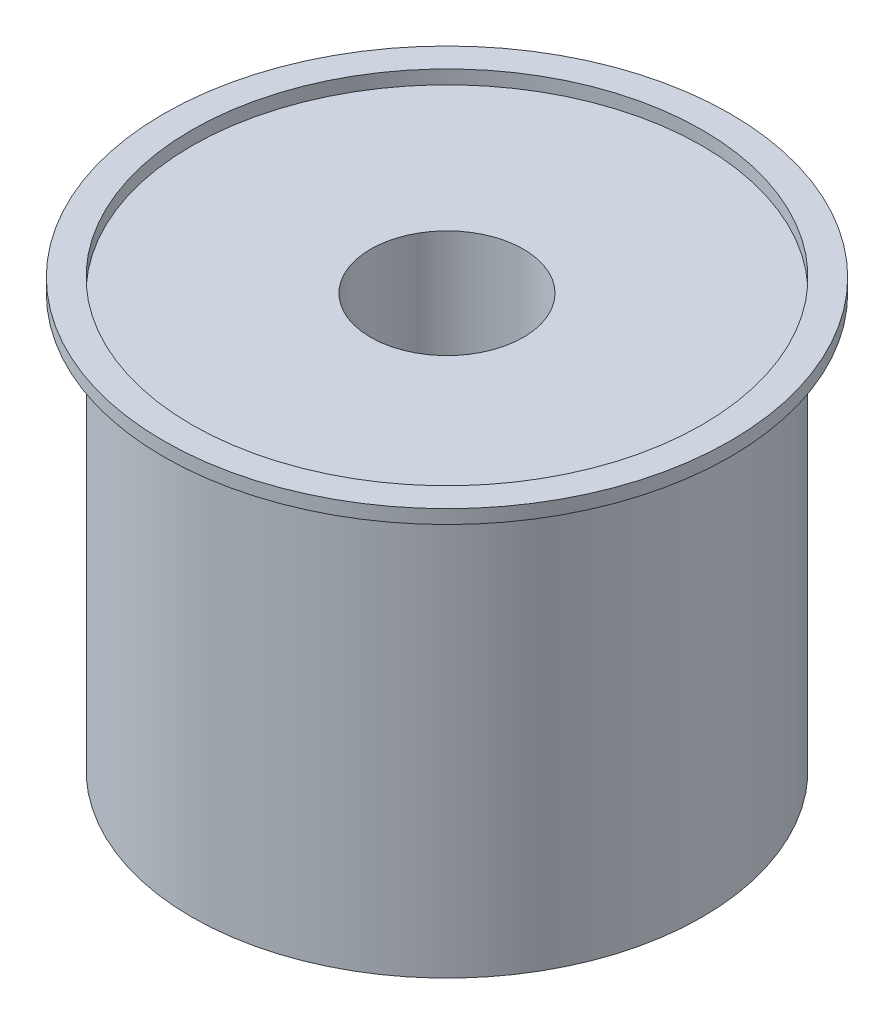
ISO-10303-21;
HEADER;
FILE_DESCRIPTION(('STEP AP214'),'2;1');
FILE_NAME('part.step','',(''),(''),'','','');
FILE_SCHEMA(('AUTOMOTIVE_DESIGN { 1 0 10303 214 1 1 1 1 }'));
ENDSEC;
DATA;
#1=APPLICATION_CONTEXT('core data for automotive mechanical design processes');
#2=APPLICATION_PROTOCOL_DEFINITION('international standard','automotive_design',2000,#1);
#3=PRODUCT_CONTEXT('',#1,'mechanical');
#4=PRODUCT('Part','Part','',(#3));
#5=PRODUCT_RELATED_PRODUCT_CATEGORY('part','',(#4));
#6=PRODUCT_DEFINITION_FORMATION('','',#4);
#7=PRODUCT_DEFINITION_CONTEXT('part definition',#1,'design');
#8=PRODUCT_DEFINITION('design','',#6,#7);
#9=PRODUCT_DEFINITION_SHAPE('','',#8);
#10=(LENGTH_UNIT() NAMED_UNIT(*) SI_UNIT(.MILLI.,.METRE.));
#11=(NAMED_UNIT(*) PLANE_ANGLE_UNIT() SI_UNIT($,.RADIAN.));
#12=(NAMED_UNIT(*) SI_UNIT($,.STERADIAN.) SOLID_ANGLE_UNIT());
#13=UNCERTAINTY_MEASURE_WITH_UNIT(LENGTH_MEASURE(1.E-05),#10,'distance_accuracy_value','');
#14=(GEOMETRIC_REPRESENTATION_CONTEXT(3) GLOBAL_UNCERTAINTY_ASSIGNED_CONTEXT((#13)) GLOBAL_UNIT_ASSIGNED_CONTEXT((#10,
#11,#12)) REPRESENTATION_CONTEXT('',''));
#15=CARTESIAN_POINT('',(0.,0.,0.));
#16=DIRECTION('',(0.,0.,1.));
#17=DIRECTION('',(1.,0.,0.));
#18=AXIS2_PLACEMENT_3D('',#15,#16,#17);
#19=CARTESIAN_POINT('',(0.,310.,0.));
#20=DIRECTION('',(0.,1.,0.));
#21=DIRECTION('',(0.,0.,1.));
#22=AXIS2_PLACEMENT_3D('',#19,#20,#21);
#23=PLANE('',#22);
#24=CARTESIAN_POINT('',(0.,310.,0.));
#25=DIRECTION('',(0.,1.,0.));
#26=DIRECTION('',(0.,0.,1.));
#27=AXIS2_PLACEMENT_3D('',#24,#25,#26);
#28=CIRCLE('',#27,205.981548735755);
#29=CARTESIAN_POINT('',(0.,310.,205.981548735755));
#30=VERTEX_POINT('',#29);
#31=EDGE_CURVE('E11',#30,#30,#28,.T.);
#32=ORIENTED_EDGE('',*,*,#31,.T.);
#33=EDGE_LOOP('',(#32));
#34=FACE_BOUND('',#33,.T.);
#35=CARTESIAN_POINT('',(0.,310.,0.));
#36=DIRECTION('',(0.,1.,0.));
#37=DIRECTION('',(0.,0.,1.));
#38=AXIS2_PLACEMENT_3D('',#35,#36,#37);
#39=CIRCLE('',#38,185.569887541615);
#40=CARTESIAN_POINT('',(0.,310.,185.569887541615));
#41=VERTEX_POINT('',#40);
#42=EDGE_CURVE('E50',#41,#41,#39,.T.);
#43=ORIENTED_EDGE('',*,*,#42,.F.);
#44=EDGE_LOOP('',(#43));
#45=FACE_BOUND('',#44,.T.);
#46=ADVANCED_FACE('F39',(#34,#45),#23,.T.);
#47=CARTESIAN_POINT('',(0.,300.,0.));
#48=DIRECTION('',(0.,1.,0.));
#49=DIRECTION('',(0.,0.,1.));
#50=AXIS2_PLACEMENT_3D('',#47,#48,#49);
#51=PLANE('',#50);
#52=CARTESIAN_POINT('',(0.,300.,0.));
#53=DIRECTION('',(0.,1.,0.));
#54=DIRECTION('',(0.,0.,1.));
#55=AXIS2_PLACEMENT_3D('',#52,#53,#54);
#56=CIRCLE('',#55,205.981548735755);
#57=CARTESIAN_POINT('',(0.,300.,205.981548735755));
#58=VERTEX_POINT('',#57);
#59=EDGE_CURVE('E43',#58,#58,#56,.T.);
#60=ORIENTED_EDGE('',*,*,#59,.F.);
#61=EDGE_LOOP('',(#60));
#62=FACE_BOUND('',#61,.T.);
#63=CARTESIAN_POINT('',(0.,300.,0.));
#64=DIRECTION('',(0.,1.,0.));
#65=DIRECTION('',(0.,0.,1.));
#66=AXIS2_PLACEMENT_3D('',#63,#64,#65);
#67=CIRCLE('',#66,185.569887541615);
#68=CARTESIAN_POINT('',(0.,300.,185.569887541615));
#69=VERTEX_POINT('',#68);
#70=EDGE_CURVE('E52',#69,#69,#67,.T.);
#71=ORIENTED_EDGE('',*,*,#70,.T.);
#72=EDGE_LOOP('',(#71));
#73=FACE_BOUND('',#72,.T.);
#74=ADVANCED_FACE('F62',(#62,#73),#51,.F.);
#75=CARTESIAN_POINT('',(0.,310.,0.));
#76=DIRECTION('',(0.,-1.,0.));
#77=DIRECTION('',(0.,0.,-1.));
#78=AXIS2_PLACEMENT_3D('',#75,#76,#77);
#79=CYLINDRICAL_SURFACE('',#78,205.981548735755);
#80=ORIENTED_EDGE('',*,*,#31,.F.);
#81=EDGE_LOOP('',(#80));
#82=FACE_BOUND('',#81,.T.);
#83=ORIENTED_EDGE('',*,*,#59,.T.);
#84=EDGE_LOOP('',(#83));
#85=FACE_BOUND('',#84,.T.);
#86=ADVANCED_FACE('F41',(#82,#85),#79,.T.);
#87=CARTESIAN_POINT('',(0.,310.,0.));
#88=DIRECTION('',(0.,-1.,0.));
#89=DIRECTION('',(0.,0.,-1.));
#90=AXIS2_PLACEMENT_3D('',#87,#88,#89);
#91=CYLINDRICAL_SURFACE('',#90,185.569887541615);
#92=ORIENTED_EDGE('',*,*,#42,.T.);
#93=EDGE_LOOP('',(#92));
#94=FACE_BOUND('',#93,.T.);
#95=ORIENTED_EDGE('',*,*,#70,.F.);
#96=EDGE_LOOP('',(#95));
#97=FACE_BOUND('',#96,.T.);
#98=ADVANCED_FACE('F58',(#94,#97),#91,.F.);
#99=CLOSED_SHELL('',(#46,#74,#86,#98));
#100=MANIFOLD_SOLID_BREP('B2',#99);
#101=CARTESIAN_POINT('',(0.,300.,0.));
#102=DIRECTION('',(0.,1.,0.));
#103=DIRECTION('',(0.,0.,1.));
#104=AXIS2_PLACEMENT_3D('',#101,#102,#103);
#105=PLANE('',#104);
#106=CARTESIAN_POINT('',(0.,300.,0.));
#107=DIRECTION('',(0.,1.,0.));
#108=DIRECTION('',(0.,0.,1.));
#109=AXIS2_PLACEMENT_3D('',#106,#107,#108);
#110=CIRCLE('',#109,185.569887541615);
#111=CARTESIAN_POINT('',(0.,300.,185.569887541615));
#112=VERTEX_POINT('',#111);
#113=EDGE_CURVE('E38',#112,#112,#110,.T.);
#114=ORIENTED_EDGE('',*,*,#113,.T.);
#115=EDGE_LOOP('',(#114));
#116=FACE_BOUND('',#115,.T.);
#117=CARTESIAN_POINT('',(0.,300.,0.));
#118=DIRECTION('',(0.,1.,0.));
#119=DIRECTION('',(0.,0.,1.));
#120=AXIS2_PLACEMENT_3D('',#117,#118,#119);
#121=CIRCLE('',#120,55.5698875416152);
#122=CARTESIAN_POINT('',(0.,300.,55.5698875416152));
#123=VERTEX_POINT('',#122);
#124=EDGE_CURVE('E112',#123,#123,#121,.T.);
#125=ORIENTED_EDGE('',*,*,#124,.F.);
#126=EDGE_LOOP('',(#125));
#127=FACE_BOUND('',#126,.T.);
#128=ADVANCED_FACE('F101',(#116,#127),#105,.T.);
#129=CARTESIAN_POINT('',(0.,0.,0.));
#130=DIRECTION('',(0.,1.,0.));
#131=DIRECTION('',(0.,0.,1.));
#132=AXIS2_PLACEMENT_3D('',#129,#130,#131);
#133=PLANE('',#132);
#134=CARTESIAN_POINT('',(0.,0.,0.));
#135=DIRECTION('',(0.,1.,0.));
#136=DIRECTION('',(0.,0.,1.));
#137=AXIS2_PLACEMENT_3D('',#134,#135,#136);
#138=CIRCLE('',#137,185.569887541615);
#139=CARTESIAN_POINT('',(0.,0.,185.569887541615));
#140=VERTEX_POINT('',#139);
#141=EDGE_CURVE('E105',#140,#140,#138,.T.);
#142=ORIENTED_EDGE('',*,*,#141,.F.);
#143=EDGE_LOOP('',(#142));
#144=FACE_BOUND('',#143,.T.);
#145=CARTESIAN_POINT('',(0.,0.,0.));
#146=DIRECTION('',(0.,1.,0.));
#147=DIRECTION('',(0.,0.,1.));
#148=AXIS2_PLACEMENT_3D('',#145,#146,#147);
#149=CIRCLE('',#148,55.5698875416152);
#150=CARTESIAN_POINT('',(0.,0.,55.5698875416152));
#151=VERTEX_POINT('',#150);
#152=EDGE_CURVE('E114',#151,#151,#149,.T.);
#153=ORIENTED_EDGE('',*,*,#152,.T.);
#154=EDGE_LOOP('',(#153));
#155=FACE_BOUND('',#154,.T.);
#156=ADVANCED_FACE('F124',(#144,#155),#133,.F.);
#157=CARTESIAN_POINT('',(0.,300.,0.));
#158=DIRECTION('',(0.,-1.,0.));
#159=DIRECTION('',(0.,0.,-1.));
#160=AXIS2_PLACEMENT_3D('',#157,#158,#159);
#161=CYLINDRICAL_SURFACE('',#160,185.569887541615);
#162=ORIENTED_EDGE('',*,*,#113,.F.);
#163=EDGE_LOOP('',(#162));
#164=FACE_BOUND('',#163,.T.);
#165=ORIENTED_EDGE('',*,*,#141,.T.);
#166=EDGE_LOOP('',(#165));
#167=FACE_BOUND('',#166,.T.);
#168=ADVANCED_FACE('F103',(#164,#167),#161,.T.);
#169=CARTESIAN_POINT('',(0.,300.,0.));
#170=DIRECTION('',(0.,-1.,0.));
#171=DIRECTION('',(0.,0.,-1.));
#172=AXIS2_PLACEMENT_3D('',#169,#170,#171);
#173=CYLINDRICAL_SURFACE('',#172,55.5698875416152);
#174=ORIENTED_EDGE('',*,*,#124,.T.);
#175=EDGE_LOOP('',(#174));
#176=FACE_BOUND('',#175,.T.);
#177=ORIENTED_EDGE('',*,*,#152,.F.);
#178=EDGE_LOOP('',(#177));
#179=FACE_BOUND('',#178,.T.);
#180=ADVANCED_FACE('F120',(#176,#179),#173,.F.);
#181=CLOSED_SHELL('',(#128,#156,#168,#180));
#182=MANIFOLD_SOLID_BREP('B6',#181);
#183=ADVANCED_BREP_SHAPE_REPRESENTATION('',(#18,#100,#182),#14);
#184=SHAPE_DEFINITION_REPRESENTATION(#9,#183);
ENDSEC;
END-ISO-10303-21;
